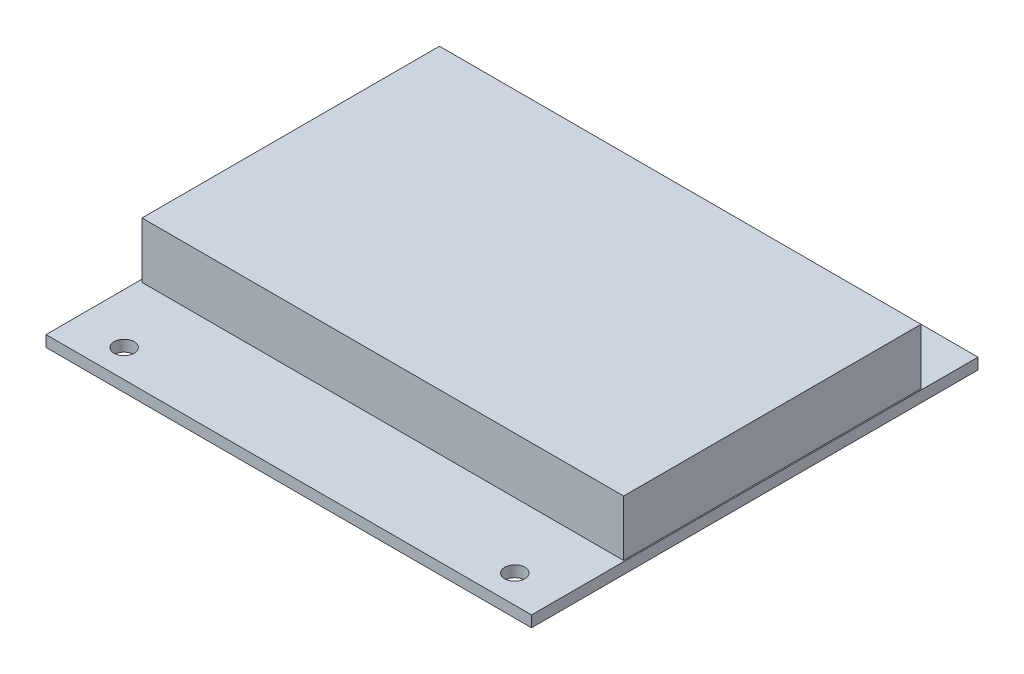
ISO-10303-21;
HEADER;
FILE_DESCRIPTION(('STEP AP214'),'2;1');
FILE_NAME('part.step','',(''),(''),'','','');
FILE_SCHEMA(('AUTOMOTIVE_DESIGN { 1 0 10303 214 1 1 1 1 }'));
ENDSEC;
DATA;
#1=APPLICATION_CONTEXT('core data for automotive mechanical design processes');
#2=APPLICATION_PROTOCOL_DEFINITION('international standard','automotive_design',2000,#1);
#3=PRODUCT_CONTEXT('',#1,'mechanical');
#4=PRODUCT('Part','Part','',(#3));
#5=PRODUCT_RELATED_PRODUCT_CATEGORY('part','',(#4));
#6=PRODUCT_DEFINITION_FORMATION('','',#4);
#7=PRODUCT_DEFINITION_CONTEXT('part definition',#1,'design');
#8=PRODUCT_DEFINITION('design','',#6,#7);
#9=PRODUCT_DEFINITION_SHAPE('','',#8);
#10=(LENGTH_UNIT() NAMED_UNIT(*) SI_UNIT(.MILLI.,.METRE.));
#11=(NAMED_UNIT(*) PLANE_ANGLE_UNIT() SI_UNIT($,.RADIAN.));
#12=(NAMED_UNIT(*) SI_UNIT($,.STERADIAN.) SOLID_ANGLE_UNIT());
#13=UNCERTAINTY_MEASURE_WITH_UNIT(LENGTH_MEASURE(1.E-05),#10,'distance_accuracy_value','');
#14=(GEOMETRIC_REPRESENTATION_CONTEXT(3) GLOBAL_UNCERTAINTY_ASSIGNED_CONTEXT((#13)) GLOBAL_UNIT_ASSIGNED_CONTEXT((#10,
#11,#12)) REPRESENTATION_CONTEXT('',''));
#15=CARTESIAN_POINT('',(0.,0.,0.));
#16=DIRECTION('',(0.,0.,1.));
#17=DIRECTION('',(1.,0.,0.));
#18=AXIS2_PLACEMENT_3D('',#15,#16,#17);
#19=CARTESIAN_POINT('',(0.,2.,0.));
#20=DIRECTION('',(0.,-1.,0.));
#21=DIRECTION('',(0.,0.,-1.));
#22=AXIS2_PLACEMENT_3D('',#19,#20,#21);
#23=PLANE('',#22);
#24=CARTESIAN_POINT('',(79.,2.,-4.99999999999999));
#25=DIRECTION('',(0.,1.,0.));
#26=DIRECTION('',(0.,0.,1.));
#27=AXIS2_PLACEMENT_3D('',#24,#25,#26);
#28=CIRCLE('',#27,1.79999999999999);
#29=CARTESIAN_POINT('',(79.,2.,-3.2));
#30=VERTEX_POINT('',#29);
#31=EDGE_CURVE('E11',#30,#30,#28,.T.);
#32=ORIENTED_EDGE('',*,*,#31,.F.);
#33=EDGE_LOOP('',(#32));
#34=FACE_BOUND('',#33,.T.);
#35=CARTESIAN_POINT('',(8.99999999999999,2.,-4.99999999999999));
#36=DIRECTION('',(0.,1.,0.));
#37=DIRECTION('',(0.,0.,1.));
#38=AXIS2_PLACEMENT_3D('',#35,#36,#37);
#39=CIRCLE('',#38,1.79999999999999);
#40=CARTESIAN_POINT('',(8.99999999999999,2.,-3.2));
#41=VERTEX_POINT('',#40);
#42=EDGE_CURVE('E169',#41,#41,#39,.T.);
#43=ORIENTED_EDGE('',*,*,#42,.F.);
#44=EDGE_LOOP('',(#43));
#45=FACE_BOUND('',#44,.T.);
#46=DIRECTION('',(0.,0.,1.));
#47=VECTOR('',#46,1.);
#48=CARTESIAN_POINT('',(0.,2.,0.));
#49=LINE('',#48,#47);
#50=CARTESIAN_POINT('',(0.,2.,-80.));
#51=VERTEX_POINT('',#50);
#52=CARTESIAN_POINT('',(0.,2.,0.));
#53=VERTEX_POINT('',#52);
#54=EDGE_CURVE('E137',#51,#53,#49,.T.);
#55=ORIENTED_EDGE('',*,*,#54,.T.);
#56=DIRECTION('',(1.,0.,0.));
#57=VECTOR('',#56,1.);
#58=CARTESIAN_POINT('',(0.,2.,0.));
#59=LINE('',#58,#57);
#60=CARTESIAN_POINT('',(87.,2.,0.));
#61=VERTEX_POINT('',#60);
#62=EDGE_CURVE('E140',#53,#61,#59,.T.);
#63=ORIENTED_EDGE('',*,*,#62,.T.);
#64=DIRECTION('',(0.,0.,-1.));
#65=VECTOR('',#64,1.);
#66=CARTESIAN_POINT('',(87.,2.,0.));
#67=LINE('',#66,#65);
#68=CARTESIAN_POINT('',(87.,2.,-80.));
#69=VERTEX_POINT('',#68);
#70=EDGE_CURVE('E143',#61,#69,#67,.T.);
#71=ORIENTED_EDGE('',*,*,#70,.T.);
#72=DIRECTION('',(-1.,0.,0.));
#73=VECTOR('',#72,1.);
#74=CARTESIAN_POINT('',(0.,2.,-80.));
#75=LINE('',#74,#73);
#76=EDGE_CURVE('E145',#69,#51,#75,.T.);
#77=ORIENTED_EDGE('',*,*,#76,.T.);
#78=EDGE_LOOP('',(#55,#63,#71,#77));
#79=FACE_BOUND('',#78,.T.);
#80=CARTESIAN_POINT('',(9.,2.,-75.));
#81=DIRECTION('',(0.,1.,0.));
#82=DIRECTION('',(0.,0.,1.));
#83=AXIS2_PLACEMENT_3D('',#80,#81,#82);
#84=CIRCLE('',#83,1.79999999999999);
#85=CARTESIAN_POINT('',(9.,2.,-73.2));
#86=VERTEX_POINT('',#85);
#87=EDGE_CURVE('E130',#86,#86,#84,.T.);
#88=ORIENTED_EDGE('',*,*,#87,.F.);
#89=EDGE_LOOP('',(#88));
#90=FACE_BOUND('',#89,.T.);
#91=CARTESIAN_POINT('',(79.,2.,-75.));
#92=DIRECTION('',(0.,1.,0.));
#93=DIRECTION('',(0.,0.,1.));
#94=AXIS2_PLACEMENT_3D('',#91,#92,#93);
#95=CIRCLE('',#94,1.79999999999999);
#96=CARTESIAN_POINT('',(79.,2.,-73.2));
#97=VERTEX_POINT('',#96);
#98=EDGE_CURVE('E122',#97,#97,#95,.T.);
#99=ORIENTED_EDGE('',*,*,#98,.F.);
#100=EDGE_LOOP('',(#99));
#101=FACE_BOUND('',#100,.T.);
#102=DIRECTION('',(0.,0.,1.));
#103=VECTOR('',#102,1.);
#104=CARTESIAN_POINT('',(0.5,2.,-70.));
#105=LINE('',#104,#103);
#106=CARTESIAN_POINT('',(0.5,2.,-70.));
#107=VERTEX_POINT('',#106);
#108=CARTESIAN_POINT('',(0.500000000000007,2.,-16.7));
#109=VERTEX_POINT('',#108);
#110=EDGE_CURVE('E118',#107,#109,#105,.T.);
#111=ORIENTED_EDGE('',*,*,#110,.F.);
#112=DIRECTION('',(-1.,0.,0.));
#113=VECTOR('',#112,1.);
#114=CARTESIAN_POINT('',(0.5,2.,-70.));
#115=LINE('',#114,#113);
#116=CARTESIAN_POINT('',(86.8,2.,-70.));
#117=VERTEX_POINT('',#116);
#118=EDGE_CURVE('E115',#117,#107,#115,.T.);
#119=ORIENTED_EDGE('',*,*,#118,.F.);
#120=DIRECTION('',(0.,0.,-1.));
#121=VECTOR('',#120,1.);
#122=CARTESIAN_POINT('',(86.8,2.,-70.));
#123=LINE('',#122,#121);
#124=CARTESIAN_POINT('',(86.8,2.,-16.7));
#125=VERTEX_POINT('',#124);
#126=EDGE_CURVE('E53',#125,#117,#123,.T.);
#127=ORIENTED_EDGE('',*,*,#126,.F.);
#128=DIRECTION('',(1.,0.,0.));
#129=VECTOR('',#128,1.);
#130=CARTESIAN_POINT('',(0.500000000000007,2.,-16.7));
#131=LINE('',#130,#129);
#132=EDGE_CURVE('E48',#109,#125,#131,.T.);
#133=ORIENTED_EDGE('',*,*,#132,.F.);
#134=EDGE_LOOP('',(#111,#119,#127,#133));
#135=FACE_BOUND('',#134,.T.);
#136=ADVANCED_FACE('F33',(#34,#45,#79,#90,#101,#135),#23,.F.);
#137=CARTESIAN_POINT('',(0.,2.,0.));
#138=DIRECTION('',(1.,0.,0.));
#139=DIRECTION('',(0.,0.,-1.));
#140=AXIS2_PLACEMENT_3D('',#137,#138,#139);
#141=PLANE('',#140);
#142=DIRECTION('',(0.,0.,1.));
#143=VECTOR('',#142,1.);
#144=CARTESIAN_POINT('',(0.,0.,0.));
#145=LINE('',#144,#143);
#146=CARTESIAN_POINT('',(0.,0.,-80.));
#147=VERTEX_POINT('',#146);
#148=CARTESIAN_POINT('',(0.,0.,0.));
#149=VERTEX_POINT('',#148);
#150=EDGE_CURVE('E134',#147,#149,#145,.T.);
#151=ORIENTED_EDGE('',*,*,#150,.T.);
#152=DIRECTION('',(0.,-1.,0.));
#153=VECTOR('',#152,1.);
#154=CARTESIAN_POINT('',(0.,2.,0.));
#155=LINE('',#154,#153);
#156=EDGE_CURVE('E163',#53,#149,#155,.T.);
#157=ORIENTED_EDGE('',*,*,#156,.F.);
#158=ORIENTED_EDGE('',*,*,#54,.F.);
#159=DIRECTION('',(0.,-1.,0.));
#160=VECTOR('',#159,1.);
#161=CARTESIAN_POINT('',(0.,2.,-80.));
#162=LINE('',#161,#160);
#163=EDGE_CURVE('E147',#51,#147,#162,.T.);
#164=ORIENTED_EDGE('',*,*,#163,.T.);
#165=EDGE_LOOP('',(#151,#157,#158,#164));
#166=FACE_BOUND('',#165,.T.);
#167=ADVANCED_FACE('F183',(#166),#141,.F.);
#168=CARTESIAN_POINT('',(0.,2.,0.));
#169=DIRECTION('',(0.,0.,-1.));
#170=DIRECTION('',(-1.,0.,0.));
#171=AXIS2_PLACEMENT_3D('',#168,#169,#170);
#172=PLANE('',#171);
#173=DIRECTION('',(1.,0.,0.));
#174=VECTOR('',#173,1.);
#175=CARTESIAN_POINT('',(0.,0.,0.));
#176=LINE('',#175,#174);
#177=CARTESIAN_POINT('',(87.,0.,0.));
#178=VERTEX_POINT('',#177);
#179=EDGE_CURVE('E150',#149,#178,#176,.T.);
#180=ORIENTED_EDGE('',*,*,#179,.T.);
#181=DIRECTION('',(0.,-1.,0.));
#182=VECTOR('',#181,1.);
#183=CARTESIAN_POINT('',(87.,2.,0.));
#184=LINE('',#183,#182);
#185=EDGE_CURVE('E160',#61,#178,#184,.T.);
#186=ORIENTED_EDGE('',*,*,#185,.F.);
#187=ORIENTED_EDGE('',*,*,#62,.F.);
#188=ORIENTED_EDGE('',*,*,#156,.T.);
#189=EDGE_LOOP('',(#180,#186,#187,#188));
#190=FACE_BOUND('',#189,.T.);
#191=ADVANCED_FACE('F238',(#190),#172,.F.);
#192=CARTESIAN_POINT('',(87.,2.,0.));
#193=DIRECTION('',(-1.,0.,0.));
#194=DIRECTION('',(0.,0.,1.));
#195=AXIS2_PLACEMENT_3D('',#192,#193,#194);
#196=PLANE('',#195);
#197=DIRECTION('',(0.,0.,-1.));
#198=VECTOR('',#197,1.);
#199=CARTESIAN_POINT('',(87.,0.,0.));
#200=LINE('',#199,#198);
#201=CARTESIAN_POINT('',(87.,0.,-80.));
#202=VERTEX_POINT('',#201);
#203=EDGE_CURVE('E152',#178,#202,#200,.T.);
#204=ORIENTED_EDGE('',*,*,#203,.T.);
#205=DIRECTION('',(0.,-1.,0.));
#206=VECTOR('',#205,1.);
#207=CARTESIAN_POINT('',(87.,2.,-80.));
#208=LINE('',#207,#206);
#209=EDGE_CURVE('E157',#69,#202,#208,.T.);
#210=ORIENTED_EDGE('',*,*,#209,.F.);
#211=ORIENTED_EDGE('',*,*,#70,.F.);
#212=ORIENTED_EDGE('',*,*,#185,.T.);
#213=EDGE_LOOP('',(#204,#210,#211,#212));
#214=FACE_BOUND('',#213,.T.);
#215=ADVANCED_FACE('F234',(#214),#196,.F.);
#216=CARTESIAN_POINT('',(0.,2.,-80.));
#217=DIRECTION('',(0.,0.,1.));
#218=DIRECTION('',(1.,0.,0.));
#219=AXIS2_PLACEMENT_3D('',#216,#217,#218);
#220=PLANE('',#219);
#221=DIRECTION('',(-1.,0.,0.));
#222=VECTOR('',#221,1.);
#223=CARTESIAN_POINT('',(0.,0.,-80.));
#224=LINE('',#223,#222);
#225=EDGE_CURVE('E141',#202,#147,#224,.T.);
#226=ORIENTED_EDGE('',*,*,#225,.T.);
#227=ORIENTED_EDGE('',*,*,#163,.F.);
#228=ORIENTED_EDGE('',*,*,#76,.F.);
#229=ORIENTED_EDGE('',*,*,#209,.T.);
#230=EDGE_LOOP('',(#226,#227,#228,#229));
#231=FACE_BOUND('',#230,.T.);
#232=ADVANCED_FACE('F230',(#231),#220,.F.);
#233=CARTESIAN_POINT('',(0.,0.,0.));
#234=DIRECTION('',(0.,-1.,0.));
#235=DIRECTION('',(0.,0.,-1.));
#236=AXIS2_PLACEMENT_3D('',#233,#234,#235);
#237=PLANE('',#236);
#238=CARTESIAN_POINT('',(79.,0.,-75.));
#239=DIRECTION('',(0.,1.,0.));
#240=DIRECTION('',(0.,0.,1.));
#241=AXIS2_PLACEMENT_3D('',#238,#239,#240);
#242=CIRCLE('',#241,1.79999999999999);
#243=CARTESIAN_POINT('',(79.,0.,-73.2));
#244=VERTEX_POINT('',#243);
#245=EDGE_CURVE('E119',#244,#244,#242,.T.);
#246=ORIENTED_EDGE('',*,*,#245,.T.);
#247=EDGE_LOOP('',(#246));
#248=FACE_BOUND('',#247,.T.);
#249=CARTESIAN_POINT('',(9.,0.,-75.));
#250=DIRECTION('',(0.,1.,0.));
#251=DIRECTION('',(0.,0.,1.));
#252=AXIS2_PLACEMENT_3D('',#249,#250,#251);
#253=CIRCLE('',#252,1.79999999999999);
#254=CARTESIAN_POINT('',(9.,0.,-73.2));
#255=VERTEX_POINT('',#254);
#256=EDGE_CURVE('E131',#255,#255,#253,.T.);
#257=ORIENTED_EDGE('',*,*,#256,.T.);
#258=EDGE_LOOP('',(#257));
#259=FACE_BOUND('',#258,.T.);
#260=ORIENTED_EDGE('',*,*,#150,.F.);
#261=ORIENTED_EDGE('',*,*,#225,.F.);
#262=ORIENTED_EDGE('',*,*,#203,.F.);
#263=ORIENTED_EDGE('',*,*,#179,.F.);
#264=EDGE_LOOP('',(#260,#261,#262,#263));
#265=FACE_BOUND('',#264,.T.);
#266=CARTESIAN_POINT('',(8.99999999999999,0.,-4.99999999999999));
#267=DIRECTION('',(0.,1.,0.));
#268=DIRECTION('',(0.,0.,1.));
#269=AXIS2_PLACEMENT_3D('',#266,#267,#268);
#270=CIRCLE('',#269,1.79999999999999);
#271=CARTESIAN_POINT('',(8.99999999999999,0.,-3.2));
#272=VERTEX_POINT('',#271);
#273=EDGE_CURVE('E166',#272,#272,#270,.T.);
#274=ORIENTED_EDGE('',*,*,#273,.T.);
#275=EDGE_LOOP('',(#274));
#276=FACE_BOUND('',#275,.T.);
#277=CARTESIAN_POINT('',(79.,0.,-4.99999999999999));
#278=DIRECTION('',(0.,1.,0.));
#279=DIRECTION('',(0.,0.,1.));
#280=AXIS2_PLACEMENT_3D('',#277,#278,#279);
#281=CIRCLE('',#280,1.79999999999999);
#282=CARTESIAN_POINT('',(79.,0.,-3.2));
#283=VERTEX_POINT('',#282);
#284=EDGE_CURVE('E41',#283,#283,#281,.T.);
#285=ORIENTED_EDGE('',*,*,#284,.T.);
#286=EDGE_LOOP('',(#285));
#287=FACE_BOUND('',#286,.T.);
#288=ADVANCED_FACE('F174',(#248,#259,#265,#276,#287),#237,.T.);
#289=CARTESIAN_POINT('',(9.,0.,-75.));
#290=DIRECTION('',(0.,1.,0.));
#291=DIRECTION('',(0.,0.,1.));
#292=AXIS2_PLACEMENT_3D('',#289,#290,#291);
#293=CYLINDRICAL_SURFACE('',#292,1.79999999999999);
#294=ORIENTED_EDGE('',*,*,#256,.F.);
#295=EDGE_LOOP('',(#294));
#296=FACE_BOUND('',#295,.T.);
#297=ORIENTED_EDGE('',*,*,#87,.T.);
#298=EDGE_LOOP('',(#297));
#299=FACE_BOUND('',#298,.T.);
#300=ADVANCED_FACE('F223',(#296,#299),#293,.F.);
#301=CARTESIAN_POINT('',(79.,0.,-75.));
#302=DIRECTION('',(0.,1.,0.));
#303=DIRECTION('',(0.,0.,1.));
#304=AXIS2_PLACEMENT_3D('',#301,#302,#303);
#305=CYLINDRICAL_SURFACE('',#304,1.79999999999999);
#306=ORIENTED_EDGE('',*,*,#245,.F.);
#307=EDGE_LOOP('',(#306));
#308=FACE_BOUND('',#307,.T.);
#309=ORIENTED_EDGE('',*,*,#98,.T.);
#310=EDGE_LOOP('',(#309));
#311=FACE_BOUND('',#310,.T.);
#312=ADVANCED_FACE('F220',(#308,#311),#305,.F.);
#313=CARTESIAN_POINT('',(8.99999999999999,0.,-4.99999999999999));
#314=DIRECTION('',(0.,1.,0.));
#315=DIRECTION('',(0.,0.,1.));
#316=AXIS2_PLACEMENT_3D('',#313,#314,#315);
#317=CYLINDRICAL_SURFACE('',#316,1.79999999999999);
#318=ORIENTED_EDGE('',*,*,#273,.F.);
#319=EDGE_LOOP('',(#318));
#320=FACE_BOUND('',#319,.T.);
#321=ORIENTED_EDGE('',*,*,#42,.T.);
#322=EDGE_LOOP('',(#321));
#323=FACE_BOUND('',#322,.T.);
#324=ADVANCED_FACE('F178',(#320,#323),#317,.F.);
#325=CARTESIAN_POINT('',(79.,0.,-4.99999999999999));
#326=DIRECTION('',(0.,1.,0.));
#327=DIRECTION('',(0.,0.,1.));
#328=AXIS2_PLACEMENT_3D('',#325,#326,#327);
#329=CYLINDRICAL_SURFACE('',#328,1.79999999999999);
#330=ORIENTED_EDGE('',*,*,#284,.F.);
#331=EDGE_LOOP('',(#330));
#332=FACE_BOUND('',#331,.T.);
#333=ORIENTED_EDGE('',*,*,#31,.T.);
#334=EDGE_LOOP('',(#333));
#335=FACE_BOUND('',#334,.T.);
#336=ADVANCED_FACE('F35',(#332,#335),#329,.F.);
#337=CARTESIAN_POINT('',(0.5,12.,-70.));
#338=DIRECTION('',(1.,0.,0.));
#339=DIRECTION('',(0.,0.,-1.));
#340=AXIS2_PLACEMENT_3D('',#337,#338,#339);
#341=PLANE('',#340);
#342=ORIENTED_EDGE('',*,*,#110,.T.);
#343=DIRECTION('',(0.,-1.,0.));
#344=VECTOR('',#343,1.);
#345=CARTESIAN_POINT('',(0.500000000000007,12.,-16.7));
#346=LINE('',#345,#344);
#347=CARTESIAN_POINT('',(0.500000000000007,12.,-16.7));
#348=VERTEX_POINT('',#347);
#349=EDGE_CURVE('E99',#348,#109,#346,.T.);
#350=ORIENTED_EDGE('',*,*,#349,.F.);
#351=DIRECTION('',(0.,0.,1.));
#352=VECTOR('',#351,1.);
#353=CARTESIAN_POINT('',(0.5,12.,-70.));
#354=LINE('',#353,#352);
#355=CARTESIAN_POINT('',(0.5,12.,-70.));
#356=VERTEX_POINT('',#355);
#357=EDGE_CURVE('E106',#356,#348,#354,.T.);
#358=ORIENTED_EDGE('',*,*,#357,.F.);
#359=DIRECTION('',(0.,-1.,0.));
#360=VECTOR('',#359,1.);
#361=CARTESIAN_POINT('',(0.5,12.,-70.));
#362=LINE('',#361,#360);
#363=EDGE_CURVE('E198',#356,#107,#362,.T.);
#364=ORIENTED_EDGE('',*,*,#363,.T.);
#365=EDGE_LOOP('',(#342,#350,#358,#364));
#366=FACE_BOUND('',#365,.T.);
#367=ADVANCED_FACE('F117',(#366),#341,.F.);
#368=CARTESIAN_POINT('',(0.500000000000007,12.,-16.7));
#369=DIRECTION('',(0.,0.,-1.));
#370=DIRECTION('',(-1.,0.,0.));
#371=AXIS2_PLACEMENT_3D('',#368,#369,#370);
#372=PLANE('',#371);
#373=ORIENTED_EDGE('',*,*,#132,.T.);
#374=DIRECTION('',(0.,-1.,0.));
#375=VECTOR('',#374,1.);
#376=CARTESIAN_POINT('',(86.8,12.,-16.7));
#377=LINE('',#376,#375);
#378=CARTESIAN_POINT('',(86.8,12.,-16.7));
#379=VERTEX_POINT('',#378);
#380=EDGE_CURVE('E102',#379,#125,#377,.T.);
#381=ORIENTED_EDGE('',*,*,#380,.F.);
#382=DIRECTION('',(1.,0.,0.));
#383=VECTOR('',#382,1.);
#384=CARTESIAN_POINT('',(0.500000000000007,12.,-16.7));
#385=LINE('',#384,#383);
#386=EDGE_CURVE('E95',#348,#379,#385,.T.);
#387=ORIENTED_EDGE('',*,*,#386,.F.);
#388=ORIENTED_EDGE('',*,*,#349,.T.);
#389=EDGE_LOOP('',(#373,#381,#387,#388));
#390=FACE_BOUND('',#389,.T.);
#391=ADVANCED_FACE('F97',(#390),#372,.F.);
#392=CARTESIAN_POINT('',(86.8,12.,-70.));
#393=DIRECTION('',(-1.,0.,0.));
#394=DIRECTION('',(0.,0.,1.));
#395=AXIS2_PLACEMENT_3D('',#392,#393,#394);
#396=PLANE('',#395);
#397=ORIENTED_EDGE('',*,*,#126,.T.);
#398=DIRECTION('',(0.,-1.,0.));
#399=VECTOR('',#398,1.);
#400=CARTESIAN_POINT('',(86.8,12.,-70.));
#401=LINE('',#400,#399);
#402=CARTESIAN_POINT('',(86.8,12.,-70.));
#403=VERTEX_POINT('',#402);
#404=EDGE_CURVE('E124',#403,#117,#401,.T.);
#405=ORIENTED_EDGE('',*,*,#404,.F.);
#406=DIRECTION('',(0.,0.,-1.));
#407=VECTOR('',#406,1.);
#408=CARTESIAN_POINT('',(86.8,12.,-70.));
#409=LINE('',#408,#407);
#410=EDGE_CURVE('E105',#379,#403,#409,.T.);
#411=ORIENTED_EDGE('',*,*,#410,.F.);
#412=ORIENTED_EDGE('',*,*,#380,.T.);
#413=EDGE_LOOP('',(#397,#405,#411,#412));
#414=FACE_BOUND('',#413,.T.);
#415=ADVANCED_FACE('F207',(#414),#396,.F.);
#416=CARTESIAN_POINT('',(0.5,12.,-70.));
#417=DIRECTION('',(0.,0.,1.));
#418=DIRECTION('',(1.,0.,0.));
#419=AXIS2_PLACEMENT_3D('',#416,#417,#418);
#420=PLANE('',#419);
#421=ORIENTED_EDGE('',*,*,#118,.T.);
#422=ORIENTED_EDGE('',*,*,#363,.F.);
#423=DIRECTION('',(-1.,0.,0.));
#424=VECTOR('',#423,1.);
#425=CARTESIAN_POINT('',(0.5,12.,-70.));
#426=LINE('',#425,#424);
#427=EDGE_CURVE('E111',#403,#356,#426,.T.);
#428=ORIENTED_EDGE('',*,*,#427,.F.);
#429=ORIENTED_EDGE('',*,*,#404,.T.);
#430=EDGE_LOOP('',(#421,#422,#428,#429));
#431=FACE_BOUND('',#430,.T.);
#432=ADVANCED_FACE('F197',(#431),#420,.F.);
#433=CARTESIAN_POINT('',(0.,12.,0.));
#434=DIRECTION('',(0.,1.,0.));
#435=DIRECTION('',(0.,0.,1.));
#436=AXIS2_PLACEMENT_3D('',#433,#434,#435);
#437=PLANE('',#436);
#438=ORIENTED_EDGE('',*,*,#357,.T.);
#439=ORIENTED_EDGE('',*,*,#386,.T.);
#440=ORIENTED_EDGE('',*,*,#410,.T.);
#441=ORIENTED_EDGE('',*,*,#427,.T.);
#442=EDGE_LOOP('',(#438,#439,#440,#441));
#443=FACE_BOUND('',#442,.T.);
#444=ADVANCED_FACE('F109',(#443),#437,.T.);
#445=CLOSED_SHELL('',(#136,#167,#191,#215,#232,#288,#300,#312,#324,#336,#367,#391,#415,#432,#444));
#446=MANIFOLD_SOLID_BREP('B2',#445);
#447=ADVANCED_BREP_SHAPE_REPRESENTATION('',(#18,#446),#14);
#448=SHAPE_DEFINITION_REPRESENTATION(#9,#447);
ENDSEC;
END-ISO-10303-21;
